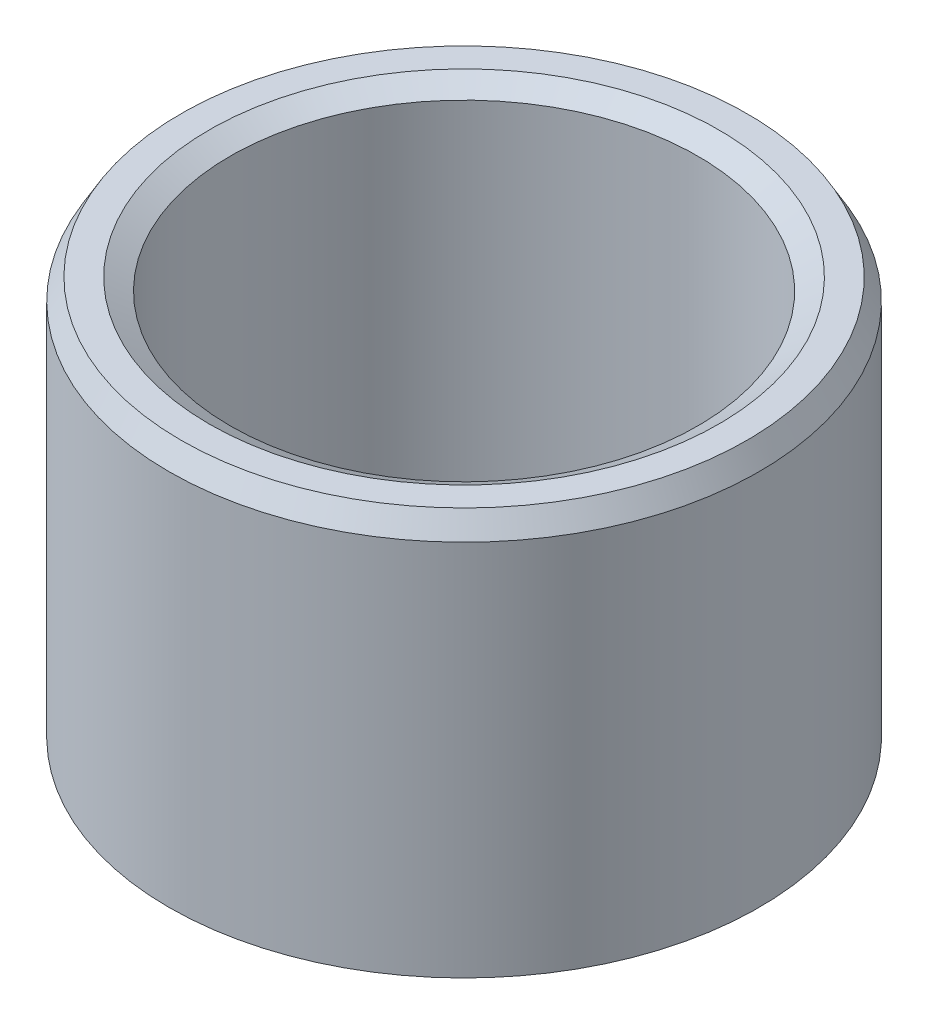
ISO-10303-21;
HEADER;
FILE_DESCRIPTION(('STEP AP214'),'2;1');
FILE_NAME('part.step','',(''),(''),'','','');
FILE_SCHEMA(('AUTOMOTIVE_DESIGN { 1 0 10303 214 1 1 1 1 }'));
ENDSEC;
DATA;
#1=APPLICATION_CONTEXT('core data for automotive mechanical design processes');
#2=APPLICATION_PROTOCOL_DEFINITION('international standard','automotive_design',2000,#1);
#3=PRODUCT_CONTEXT('',#1,'mechanical');
#4=PRODUCT('Part','Part','',(#3));
#5=PRODUCT_RELATED_PRODUCT_CATEGORY('part','',(#4));
#6=PRODUCT_DEFINITION_FORMATION('','',#4);
#7=PRODUCT_DEFINITION_CONTEXT('part definition',#1,'design');
#8=PRODUCT_DEFINITION('design','',#6,#7);
#9=PRODUCT_DEFINITION_SHAPE('','',#8);
#10=(LENGTH_UNIT() NAMED_UNIT(*) SI_UNIT(.MILLI.,.METRE.));
#11=(NAMED_UNIT(*) PLANE_ANGLE_UNIT() SI_UNIT($,.RADIAN.));
#12=(NAMED_UNIT(*) SI_UNIT($,.STERADIAN.) SOLID_ANGLE_UNIT());
#13=UNCERTAINTY_MEASURE_WITH_UNIT(LENGTH_MEASURE(1.E-05),#10,'distance_accuracy_value','');
#14=(GEOMETRIC_REPRESENTATION_CONTEXT(3) GLOBAL_UNCERTAINTY_ASSIGNED_CONTEXT((#13)) GLOBAL_UNIT_ASSIGNED_CONTEXT((#10,
#11,#12)) REPRESENTATION_CONTEXT('',''));
#15=CARTESIAN_POINT('',(0.,0.,0.));
#16=DIRECTION('',(0.,0.,1.));
#17=DIRECTION('',(1.,0.,0.));
#18=AXIS2_PLACEMENT_3D('',#15,#16,#17);
#19=CARTESIAN_POINT('',(0.,62.6102338731628,0.));
#20=DIRECTION('',(0.,-1.,0.));
#21=DIRECTION('',(0.,0.,-1.));
#22=AXIS2_PLACEMENT_3D('',#19,#20,#21);
#23=CYLINDRICAL_SURFACE('',#22,45.);
#24=CARTESIAN_POINT('',(0.,1.85394979627315,0.));
#25=DIRECTION('',(0.,1.,0.));
#26=DIRECTION('',(0.,0.,1.));
#27=AXIS2_PLACEMENT_3D('',#24,#25,#26);
#28=CIRCLE('',#27,45.);
#29=CARTESIAN_POINT('',(0.,1.85394979627315,45.));
#30=VERTEX_POINT('',#29);
#31=EDGE_CURVE('E10',#30,#30,#28,.T.);
#32=ORIENTED_EDGE('',*,*,#31,.T.);
#33=EDGE_LOOP('',(#32));
#34=FACE_BOUND('',#33,.T.);
#35=CARTESIAN_POINT('',(0.,59.3990986313358,0.));
#36=DIRECTION('',(0.,1.,0.));
#37=DIRECTION('',(0.,0.,1.));
#38=AXIS2_PLACEMENT_3D('',#35,#36,#37);
#39=CIRCLE('',#38,45.);
#40=CARTESIAN_POINT('',(0.,59.3990986313358,45.));
#41=VERTEX_POINT('',#40);
#42=EDGE_CURVE('E50',#41,#41,#39,.F.);
#43=ORIENTED_EDGE('',*,*,#42,.T.);
#44=EDGE_LOOP('',(#43));
#45=FACE_BOUND('',#44,.T.);
#46=ADVANCED_FACE('F39',(#34,#45),#23,.T.);
#47=CARTESIAN_POINT('',(0.,62.6102338731628,0.));
#48=DIRECTION('',(0.,1.,0.));
#49=DIRECTION('',(0.,0.,1.));
#50=AXIS2_PLACEMENT_3D('',#47,#48,#49);
#51=PLANE('',#50);
#52=CARTESIAN_POINT('',(0.,62.6102338731628,0.));
#53=DIRECTION('',(0.,1.,0.));
#54=DIRECTION('',(0.,0.,1.));
#55=AXIS2_PLACEMENT_3D('',#52,#53,#54);
#56=CIRCLE('',#55,38.8554359328645);
#57=CARTESIAN_POINT('',(0.,62.6102338731628,38.8554359328645));
#58=VERTEX_POINT('',#57);
#59=EDGE_CURVE('E58',#58,#58,#56,.F.);
#60=ORIENTED_EDGE('',*,*,#59,.T.);
#61=EDGE_LOOP('',(#60));
#62=FACE_BOUND('',#61,.T.);
#63=CARTESIAN_POINT('',(0.,62.6102338731628,0.));
#64=DIRECTION('',(0.,1.,0.));
#65=DIRECTION('',(0.,0.,1.));
#66=AXIS2_PLACEMENT_3D('',#63,#64,#65);
#67=CIRCLE('',#66,43.1460502037269);
#68=CARTESIAN_POINT('',(0.,62.6102338731628,43.1460502037269));
#69=VERTEX_POINT('',#68);
#70=EDGE_CURVE('E61',#69,#69,#67,.T.);
#71=ORIENTED_EDGE('',*,*,#70,.T.);
#72=EDGE_LOOP('',(#71));
#73=FACE_BOUND('',#72,.T.);
#74=ADVANCED_FACE('F88',(#62,#73),#51,.T.);
#75=CARTESIAN_POINT('',(0.,0.,0.));
#76=DIRECTION('',(0.,1.,0.));
#77=DIRECTION('',(0.,0.,1.));
#78=AXIS2_PLACEMENT_3D('',#75,#76,#77);
#79=PLANE('',#78);
#80=CARTESIAN_POINT('',(0.,0.,0.));
#81=DIRECTION('',(0.,1.,0.));
#82=DIRECTION('',(0.,0.,1.));
#83=AXIS2_PLACEMENT_3D('',#80,#81,#82);
#84=CIRCLE('',#83,37.4982504873106);
#85=CARTESIAN_POINT('',(0.,0.,37.4982504873106));
#86=VERTEX_POINT('',#85);
#87=EDGE_CURVE('E51',#86,#86,#84,.T.);
#88=ORIENTED_EDGE('',*,*,#87,.T.);
#89=EDGE_LOOP('',(#88));
#90=FACE_BOUND('',#89,.T.);
#91=CARTESIAN_POINT('',(0.,0.,0.));
#92=DIRECTION('',(0.,1.,0.));
#93=DIRECTION('',(0.,0.,1.));
#94=AXIS2_PLACEMENT_3D('',#91,#92,#93);
#95=CIRCLE('',#94,41.7888647581729);
#96=CARTESIAN_POINT('',(0.,0.,41.7888647581729));
#97=VERTEX_POINT('',#96);
#98=EDGE_CURVE('E54',#97,#97,#95,.F.);
#99=ORIENTED_EDGE('',*,*,#98,.T.);
#100=EDGE_LOOP('',(#99));
#101=FACE_BOUND('',#100,.T.);
#102=ADVANCED_FACE('F83',(#90,#101),#79,.F.);
#103=CARTESIAN_POINT('',(0.,62.6102338731628,0.));
#104=DIRECTION('',(0.,-1.,0.));
#105=DIRECTION('',(0.,0.,-1.));
#106=AXIS2_PLACEMENT_3D('',#103,#104,#105);
#107=CYLINDRICAL_SURFACE('',#106,35.6443006910374);
#108=CARTESIAN_POINT('',(0.,60.7562840768897,0.));
#109=DIRECTION('',(0.,1.,0.));
#110=DIRECTION('',(0.,0.,1.));
#111=AXIS2_PLACEMENT_3D('',#108,#109,#110);
#112=CIRCLE('',#111,35.6443006910374);
#113=CARTESIAN_POINT('',(0.,60.7562840768897,35.6443006910374));
#114=VERTEX_POINT('',#113);
#115=EDGE_CURVE('E67',#114,#114,#112,.T.);
#116=ORIENTED_EDGE('',*,*,#115,.T.);
#117=EDGE_LOOP('',(#116));
#118=FACE_BOUND('',#117,.T.);
#119=CARTESIAN_POINT('',(0.,3.21113524182706,0.));
#120=DIRECTION('',(0.,1.,0.));
#121=DIRECTION('',(0.,0.,1.));
#122=AXIS2_PLACEMENT_3D('',#119,#120,#121);
#123=CIRCLE('',#122,35.6443006910374);
#124=CARTESIAN_POINT('',(0.,3.21113524182706,35.6443006910374));
#125=VERTEX_POINT('',#124);
#126=EDGE_CURVE('E69',#125,#125,#123,.F.);
#127=ORIENTED_EDGE('',*,*,#126,.T.);
#128=EDGE_LOOP('',(#127));
#129=FACE_BOUND('',#128,.T.);
#130=ADVANCED_FACE('F71',(#118,#129),#107,.F.);
#131=CARTESIAN_POINT('',(0.,60.7562840768897,0.));
#132=DIRECTION('',(0.,1.,0.));
#133=DIRECTION('',(0.,0.,1.));
#134=AXIS2_PLACEMENT_3D('',#131,#132,#133);
#135=CONICAL_SURFACE('',#134,35.6443006910374,1.0471975511966);
#136=ORIENTED_EDGE('',*,*,#59,.F.);
#137=EDGE_LOOP('',(#136));
#138=FACE_BOUND('',#137,.T.);
#139=ORIENTED_EDGE('',*,*,#115,.F.);
#140=EDGE_LOOP('',(#139));
#141=FACE_BOUND('',#140,.T.);
#142=ADVANCED_FACE('F77',(#138,#141),#135,.F.);
#143=CARTESIAN_POINT('',(0.,0.,0.));
#144=DIRECTION('',(0.,-1.,0.));
#145=DIRECTION('',(0.,0.,-1.));
#146=AXIS2_PLACEMENT_3D('',#143,#144,#145);
#147=CONICAL_SURFACE('',#146,37.4982504873106,0.523598775598294);
#148=ORIENTED_EDGE('',*,*,#126,.F.);
#149=EDGE_LOOP('',(#148));
#150=FACE_BOUND('',#149,.T.);
#151=ORIENTED_EDGE('',*,*,#87,.F.);
#152=EDGE_LOOP('',(#151));
#153=FACE_BOUND('',#152,.T.);
#154=ADVANCED_FACE('F73',(#150,#153),#147,.F.);
#155=CARTESIAN_POINT('',(0.,1.85394979627315,0.));
#156=DIRECTION('',(0.,1.,0.));
#157=DIRECTION('',(0.,0.,1.));
#158=AXIS2_PLACEMENT_3D('',#155,#156,#157);
#159=CONICAL_SURFACE('',#158,45.,1.0471975511966);
#160=CARTESIAN_POINT('',(0.,0.,41.7888647581729));
#161=CARTESIAN_POINT('',(0.,0.0193119770445103,41.8223140836086));
#162=CARTESIAN_POINT('',(0.,0.0386239540890227,41.8557634090443));
#163=CARTESIAN_POINT('',(0.,0.0772479081780475,41.9226620599157));
#164=CARTESIAN_POINT('',(0.,0.0965598852225599,41.9561113853514));
#165=CARTESIAN_POINT('',(0.,0.135183839311584,42.0230100362228));
#166=CARTESIAN_POINT('',(0.,0.154495816356095,42.0564593616585));
#167=CARTESIAN_POINT('',(0.,0.193119770445119,42.1233580125299));
#168=CARTESIAN_POINT('',(0.,0.212431747489631,42.1568073379656));
#169=CARTESIAN_POINT('',(0.,0.251055701578655,42.223705988837));
#170=CARTESIAN_POINT('',(0.,0.270367678623166,42.2571553142727));
#171=CARTESIAN_POINT('',(0.,0.30899163271219,42.3240539651441));
#172=CARTESIAN_POINT('',(0.,0.328303609756703,42.3575032905798));
#173=CARTESIAN_POINT('',(0.,0.366927563845727,42.4244019414512));
#174=CARTESIAN_POINT('',(0.,0.386239540890239,42.4578512668869));
#175=CARTESIAN_POINT('',(0.,0.424863494979262,42.5247499177583));
#176=CARTESIAN_POINT('',(0.,0.444175472023773,42.558199243194));
#177=CARTESIAN_POINT('',(0.,0.482799426112798,42.6250978940654));
#178=CARTESIAN_POINT('',(0.,0.502111403157311,42.6585472195011));
#179=CARTESIAN_POINT('',(0.,0.540735357246335,42.7254458703725));
#180=CARTESIAN_POINT('',(0.,0.560047334290846,42.7588951958082));
#181=CARTESIAN_POINT('',(0.,0.598671288379869,42.8257938466796));
#182=CARTESIAN_POINT('',(0.,0.617983265424382,42.8592431721153));
#183=CARTESIAN_POINT('',(0.,0.656607219513405,42.9261418229867));
#184=CARTESIAN_POINT('',(0.,0.675919196557917,42.9595911484224));
#185=CARTESIAN_POINT('',(0.,0.714543150646941,43.0264897992938));
#186=CARTESIAN_POINT('',(0.,0.733855127691454,43.0599391247295));
#187=CARTESIAN_POINT('',(0.,0.772479081780478,43.1268377756009));
#188=CARTESIAN_POINT('',(0.,0.791791058824989,43.1602871010366));
#189=CARTESIAN_POINT('',(0.,0.830415012914012,43.227185751908));
#190=CARTESIAN_POINT('',(0.,0.849726989958524,43.2606350773437));
#191=CARTESIAN_POINT('',(0.,0.888350944047548,43.3275337282151));
#192=CARTESIAN_POINT('',(0.,0.907662921092061,43.3609830536508));
#193=CARTESIAN_POINT('',(0.,0.946286875181085,43.4278817045222));
#194=CARTESIAN_POINT('',(0.,0.965598852225596,43.4613310299579));
#195=CARTESIAN_POINT('',(0.,1.00422280631462,43.5282296808293));
#196=CARTESIAN_POINT('',(0.,1.02353478335913,43.561679006265));
#197=CARTESIAN_POINT('',(0.,1.06215873744816,43.6285776571364));
#198=CARTESIAN_POINT('',(0.,1.08147071449267,43.6620269825721));
#199=CARTESIAN_POINT('',(0.,1.12009466858169,43.7289256334435));
#200=CARTESIAN_POINT('',(0.,1.1394066456262,43.7623749588791));
#201=CARTESIAN_POINT('',(0.,1.17803059971523,43.8292736097505));
#202=CARTESIAN_POINT('',(0.,1.19734257675974,43.8627229351862));
#203=CARTESIAN_POINT('',(0.,1.23596653084876,43.9296215860576));
#204=CARTESIAN_POINT('',(0.,1.25527850789327,43.9630709114933));
#205=CARTESIAN_POINT('',(0.,1.2939024619823,44.0299695623647));
#206=CARTESIAN_POINT('',(0.,1.31321443902681,44.0634188878004));
#207=CARTESIAN_POINT('',(0.,1.35183839311584,44.1303175386718));
#208=CARTESIAN_POINT('',(0.,1.37115037016035,44.1637668641075));
#209=CARTESIAN_POINT('',(0.,1.40977432424937,44.2306655149789));
#210=CARTESIAN_POINT('',(0.,1.42908630129388,44.2641148404146));
#211=CARTESIAN_POINT('',(0.,1.46771025538291,44.331013491286));
#212=CARTESIAN_POINT('',(0.,1.48702223242742,44.3644628167217));
#213=CARTESIAN_POINT('',(0.,1.52564618651644,44.4313614675931));
#214=CARTESIAN_POINT('',(0.,1.54495816356095,44.4648107930288));
#215=CARTESIAN_POINT('',(0.,1.58358211764998,44.5317094439002));
#216=CARTESIAN_POINT('',(0.,1.60289409469449,44.5651587693359));
#217=CARTESIAN_POINT('',(0.,1.64151804878351,44.6320574202073));
#218=CARTESIAN_POINT('',(0.,1.66083002582803,44.665506745643));
#219=CARTESIAN_POINT('',(0.,1.69945397991705,44.7324053965144));
#220=CARTESIAN_POINT('',(0.,1.71876595696156,44.7658547219501));
#221=CARTESIAN_POINT('',(0.,1.75738991105058,44.8327533728215));
#222=CARTESIAN_POINT('',(0.,1.7767018880951,44.8662026982572));
#223=CARTESIAN_POINT('',(0.,1.81532584218412,44.9331013491286));
#224=CARTESIAN_POINT('',(0.,1.83463781922863,44.9665506745643));
#225=CARTESIAN_POINT('',(0.,1.85394979627315,45.));
#226=B_SPLINE_CURVE_WITH_KNOTS('',3,(#160,#161,#162,#163,#164,#165,#166,#167,#168,#169,#170,
#171,#172,#173,#174,#175,#176,#177,#178,#179,#180,#181,#182,#183,#184,#185,#186,#187,#188,#189,
#190,#191,#192,#193,#194,#195,#196,#197,#198,#199,#200,#201,#202,#203,#204,#205,#206,#207,#208,
#209,#210,#211,#212,#213,#214,#215,#216,#217,#218,#219,#220,#221,#222,#223,#224,#225),
.UNSPECIFIED.,.F.,.F.,(4,2,2,2,2,2,2,2,2,2,2,2,2,2,2,2,2,2,2,2,2,2,2,2,2,2,2,2,2,2,2,2,4),(0.,
0.115871862267074,0.231743724534142,0.347615586801216,0.46348744906829,0.579359311335364,
0.695231173602432,0.811103035869506,0.92697489813658,1.04284676040365,1.15871862267072,
1.2745904849378,1.39046234720487,1.50633420947194,1.62220607173901,1.73807793400609,
1.85394979627315,1.96982165854023,2.0856935208073,2.20156538307438,2.31743724534144,
2.43330910760852,2.54918096987559,2.66505283214266,2.78092469440973,2.89679655667681,
3.01266841894388,3.12854028121095,3.24441214347802,3.3602840057451,3.47615586801217,
3.59202773027924,3.70789959254631),.UNSPECIFIED.);
#227=EDGE_CURVE('BSEAM76',#97,#30,#226,.T.);
#228=ORIENTED_EDGE('',*,*,#98,.F.);
#229=ORIENTED_EDGE('',*,*,#31,.F.);
#230=ORIENTED_EDGE('',*,*,#227,.T.);
#231=ORIENTED_EDGE('',*,*,#227,.F.);
#232=EDGE_LOOP('',(#228,#230,#229,#231));
#233=FACE_BOUND('',#232,.T.);
#234=ADVANCED_FACE('F76',(#233),#159,.T.);
#235=CARTESIAN_POINT('',(0.,62.6102338731628,0.));
#236=DIRECTION('',(0.,-1.,0.));
#237=DIRECTION('',(0.,0.,-1.));
#238=AXIS2_PLACEMENT_3D('',#235,#236,#237);
#239=CONICAL_SURFACE('',#238,43.1460502037269,0.523598775598292);
#240=ORIENTED_EDGE('',*,*,#42,.F.);
#241=EDGE_LOOP('',(#240));
#242=FACE_BOUND('',#241,.T.);
#243=ORIENTED_EDGE('',*,*,#70,.F.);
#244=EDGE_LOOP('',(#243));
#245=FACE_BOUND('',#244,.T.);
#246=ADVANCED_FACE('F45',(#242,#245),#239,.T.);
#247=CLOSED_SHELL('',(#46,#74,#102,#130,#142,#154,#234,#246));
#248=MANIFOLD_SOLID_BREP('B2',#247);
#249=ADVANCED_BREP_SHAPE_REPRESENTATION('',(#18,#248),#14);
#250=SHAPE_DEFINITION_REPRESENTATION(#9,#249);
ENDSEC;
END-ISO-10303-21;
